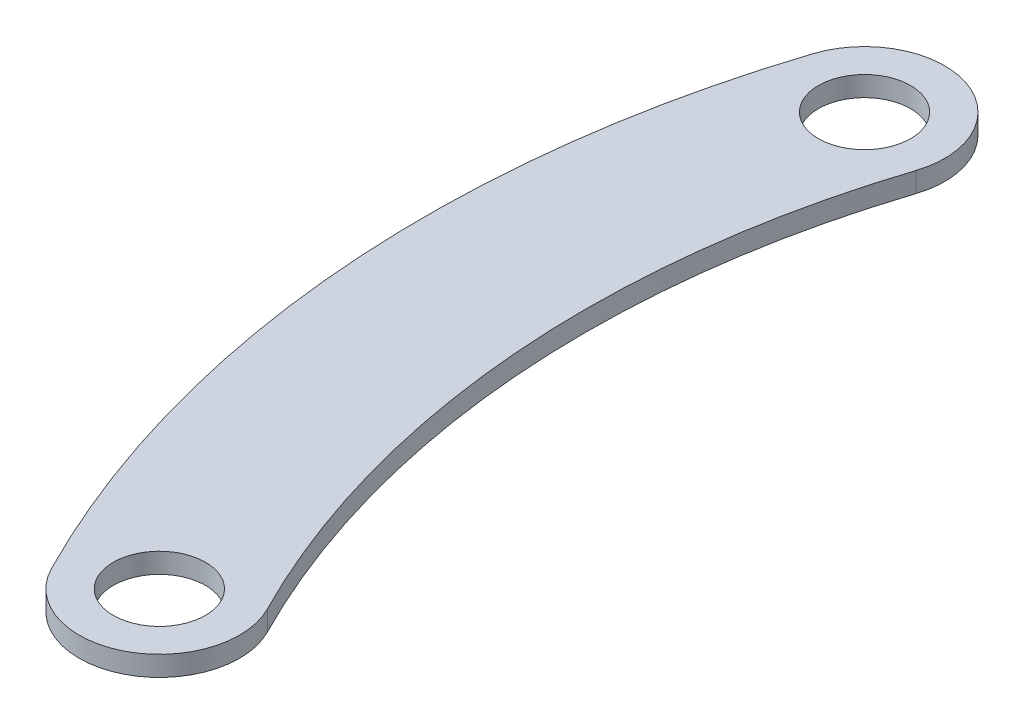
ISO-10303-21;
HEADER;
FILE_DESCRIPTION(('STEP AP214'),'2;1');
FILE_NAME('part.step','',(''),(''),'','','');
FILE_SCHEMA(('AUTOMOTIVE_DESIGN { 1 0 10303 214 1 1 1 1 }'));
ENDSEC;
DATA;
#1=APPLICATION_CONTEXT('core data for automotive mechanical design processes');
#2=APPLICATION_PROTOCOL_DEFINITION('international standard','automotive_design',2000,#1);
#3=PRODUCT_CONTEXT('',#1,'mechanical');
#4=PRODUCT('Part','Part','',(#3));
#5=PRODUCT_RELATED_PRODUCT_CATEGORY('part','',(#4));
#6=PRODUCT_DEFINITION_FORMATION('','',#4);
#7=PRODUCT_DEFINITION_CONTEXT('part definition',#1,'design');
#8=PRODUCT_DEFINITION('design','',#6,#7);
#9=PRODUCT_DEFINITION_SHAPE('','',#8);
#10=(LENGTH_UNIT() NAMED_UNIT(*) SI_UNIT(.MILLI.,.METRE.));
#11=(NAMED_UNIT(*) PLANE_ANGLE_UNIT() SI_UNIT($,.RADIAN.));
#12=(NAMED_UNIT(*) SI_UNIT($,.STERADIAN.) SOLID_ANGLE_UNIT());
#13=UNCERTAINTY_MEASURE_WITH_UNIT(LENGTH_MEASURE(1.E-05),#10,'distance_accuracy_value','');
#14=(GEOMETRIC_REPRESENTATION_CONTEXT(3) GLOBAL_UNCERTAINTY_ASSIGNED_CONTEXT((#13)) GLOBAL_UNIT_ASSIGNED_CONTEXT((#10,
#11,#12)) REPRESENTATION_CONTEXT('',''));
#15=CARTESIAN_POINT('',(0.,0.,0.));
#16=DIRECTION('',(0.,0.,1.));
#17=DIRECTION('',(1.,0.,0.));
#18=AXIS2_PLACEMENT_3D('',#15,#16,#17);
#19=CARTESIAN_POINT('',(-128.550200418903,1.8375,3.64745578806773));
#20=DIRECTION('',(0.,1.,0.));
#21=DIRECTION('',(0.,0.,1.));
#22=AXIS2_PLACEMENT_3D('',#19,#20,#21);
#23=PLANE('',#22);
#24=CARTESIAN_POINT('',(-144.599606430885,1.8375,-1.56619856013611));
#25=DIRECTION('',(0.,1.,0.));
#26=DIRECTION('',(0.,0.,1.));
#27=AXIS2_PLACEMENT_3D('',#24,#25,#26);
#28=CIRCLE('',#27,1.54999999999999);
#29=CARTESIAN_POINT('',(-144.599606430885,1.8375,-0.0161985601361142));
#30=VERTEX_POINT('',#29);
#31=EDGE_CURVE('E117',#30,#30,#28,.T.);
#32=ORIENTED_EDGE('',*,*,#31,.F.);
#33=EDGE_LOOP('',(#32));
#34=FACE_BOUND('',#33,.T.);
#35=CARTESIAN_POINT('',(-142.571302745854,1.8375,24.1851770976938));
#36=DIRECTION('',(0.,1.,0.));
#37=DIRECTION('',(0.,0.,1.));
#38=AXIS2_PLACEMENT_3D('',#35,#36,#37);
#39=CIRCLE('',#38,1.54999999999999);
#40=CARTESIAN_POINT('',(-142.571302745854,1.8375,25.7351770976938));
#41=VERTEX_POINT('',#40);
#42=EDGE_CURVE('E118',#41,#41,#39,.T.);
#43=ORIENTED_EDGE('',*,*,#42,.F.);
#44=EDGE_LOOP('',(#43));
#45=FACE_BOUND('',#44,.T.);
#46=CARTESIAN_POINT('',(-144.599606430885,1.8375,-1.56619856013611));
#47=DIRECTION('',(0.,1.,0.));
#48=DIRECTION('',(0.,0.,1.));
#49=AXIS2_PLACEMENT_3D('',#46,#47,#48);
#50=CIRCLE('',#49,2.7);
#51=CARTESIAN_POINT('',(-142.031701468968,1.8375,-0.73201386442351));
#52=VERTEX_POINT('',#51);
#53=CARTESIAN_POINT('',(-147.167511392802,1.8375,-2.40038325584874));
#54=VERTEX_POINT('',#53);
#55=EDGE_CURVE('E88',#52,#54,#50,.T.);
#56=ORIENTED_EDGE('',*,*,#55,.T.);
#57=CARTESIAN_POINT('',(-112.50079440692,1.8375,8.86111013627158));
#58=DIRECTION('',(0.,1.,0.));
#59=DIRECTION('',(0.,0.,1.));
#60=AXIS2_PLACEMENT_3D('',#57,#58,#59);
#61=CIRCLE('',#60,36.45);
#62=CARTESIAN_POINT('',(-144.976943412968,1.8375,25.4111024546076));
#63=VERTEX_POINT('',#62);
#64=EDGE_CURVE('E84',#54,#63,#61,.T.);
#65=ORIENTED_EDGE('',*,*,#64,.T.);
#66=CARTESIAN_POINT('',(-142.571302745854,1.8375,24.1851770976938));
#67=DIRECTION('',(0.,1.,0.));
#68=DIRECTION('',(0.,0.,1.));
#69=AXIS2_PLACEMENT_3D('',#66,#67,#68);
#70=CIRCLE('',#69,2.7);
#71=CARTESIAN_POINT('',(-140.165662078739,1.8375,22.95925174078));
#72=VERTEX_POINT('',#71);
#73=EDGE_CURVE('E86',#63,#72,#70,.T.);
#74=ORIENTED_EDGE('',*,*,#73,.T.);
#75=CARTESIAN_POINT('',(-112.50079440692,1.8375,8.86111013627158));
#76=DIRECTION('',(0.,-1.,0.));
#77=DIRECTION('',(0.,0.,1.));
#78=AXIS2_PLACEMENT_3D('',#75,#76,#77);
#79=CIRCLE('',#78,31.05);
#80=EDGE_CURVE('E54',#72,#52,#79,.T.);
#81=ORIENTED_EDGE('',*,*,#80,.T.);
#82=EDGE_LOOP('',(#56,#65,#74,#81));
#83=FACE_BOUND('',#82,.T.);
#84=ADVANCED_FACE('F37',(#34,#45,#83),#23,.T.);
#85=CARTESIAN_POINT('',(-128.550200418903,1.1625,3.64745578806773));
#86=DIRECTION('',(0.,1.,0.));
#87=DIRECTION('',(0.,0.,1.));
#88=AXIS2_PLACEMENT_3D('',#85,#86,#87);
#89=PLANE('',#88);
#90=CARTESIAN_POINT('',(-144.599606430885,1.1625,-1.56619856013611));
#91=DIRECTION('',(0.,1.,0.));
#92=DIRECTION('',(0.,0.,1.));
#93=AXIS2_PLACEMENT_3D('',#90,#91,#92);
#94=CIRCLE('',#93,1.54999999999999);
#95=CARTESIAN_POINT('',(-144.599606430885,1.1625,-0.0161985601361142));
#96=VERTEX_POINT('',#95);
#97=EDGE_CURVE('E103',#96,#96,#94,.F.);
#98=ORIENTED_EDGE('',*,*,#97,.F.);
#99=EDGE_LOOP('',(#98));
#100=FACE_BOUND('',#99,.T.);
#101=CARTESIAN_POINT('',(-142.571302745854,1.1625,24.1851770976938));
#102=DIRECTION('',(0.,1.,0.));
#103=DIRECTION('',(0.,0.,1.));
#104=AXIS2_PLACEMENT_3D('',#101,#102,#103);
#105=CIRCLE('',#104,1.54999999999999);
#106=CARTESIAN_POINT('',(-142.571302745854,1.1625,25.7351770976938));
#107=VERTEX_POINT('',#106);
#108=EDGE_CURVE('E114',#107,#107,#105,.F.);
#109=ORIENTED_EDGE('',*,*,#108,.F.);
#110=EDGE_LOOP('',(#109));
#111=FACE_BOUND('',#110,.T.);
#112=CARTESIAN_POINT('',(-144.599606430885,1.1625,-1.56619856013611));
#113=DIRECTION('',(0.,1.,0.));
#114=DIRECTION('',(0.,0.,1.));
#115=AXIS2_PLACEMENT_3D('',#112,#113,#114);
#116=CIRCLE('',#115,2.7);
#117=CARTESIAN_POINT('',(-142.031701468968,1.1625,-0.73201386442351));
#118=VERTEX_POINT('',#117);
#119=CARTESIAN_POINT('',(-147.167511392802,1.1625,-2.40038325584874));
#120=VERTEX_POINT('',#119);
#121=EDGE_CURVE('E100',#118,#120,#116,.T.);
#122=ORIENTED_EDGE('',*,*,#121,.F.);
#123=CARTESIAN_POINT('',(-112.50079440692,1.1625,8.86111013627158));
#124=DIRECTION('',(0.,-1.,0.));
#125=DIRECTION('',(0.,0.,1.));
#126=AXIS2_PLACEMENT_3D('',#123,#124,#125);
#127=CIRCLE('',#126,31.05);
#128=CARTESIAN_POINT('',(-140.165662078739,1.1625,22.95925174078));
#129=VERTEX_POINT('',#128);
#130=EDGE_CURVE('E77',#129,#118,#127,.T.);
#131=ORIENTED_EDGE('',*,*,#130,.F.);
#132=CARTESIAN_POINT('',(-142.571302745854,1.1625,24.1851770976938));
#133=DIRECTION('',(0.,1.,0.));
#134=DIRECTION('',(0.,0.,1.));
#135=AXIS2_PLACEMENT_3D('',#132,#133,#134);
#136=CIRCLE('',#135,2.7);
#137=CARTESIAN_POINT('',(-144.976943412968,1.1625,25.4111024546076));
#138=VERTEX_POINT('',#137);
#139=EDGE_CURVE('E71',#138,#129,#136,.T.);
#140=ORIENTED_EDGE('',*,*,#139,.F.);
#141=CARTESIAN_POINT('',(-112.50079440692,1.1625,8.86111013627158));
#142=DIRECTION('',(0.,1.,0.));
#143=DIRECTION('',(0.,0.,1.));
#144=AXIS2_PLACEMENT_3D('',#141,#142,#143);
#145=CIRCLE('',#144,36.45);
#146=EDGE_CURVE('E92',#120,#138,#145,.T.);
#147=ORIENTED_EDGE('',*,*,#146,.F.);
#148=EDGE_LOOP('',(#122,#131,#140,#147));
#149=FACE_BOUND('',#148,.T.);
#150=ADVANCED_FACE('F111',(#100,#111,#149),#89,.F.);
#151=CARTESIAN_POINT('',(-144.599606430885,1.8375,-1.56619856013611));
#152=DIRECTION('',(0.,-1.,0.));
#153=DIRECTION('',(0.,0.,-1.));
#154=AXIS2_PLACEMENT_3D('',#151,#152,#153);
#155=CYLINDRICAL_SURFACE('',#154,2.7);
#156=ORIENTED_EDGE('',*,*,#121,.T.);
#157=DIRECTION('',(0.,-1.,0.));
#158=VECTOR('',#157,1.);
#159=CARTESIAN_POINT('',(-147.167511392802,1.8375,-2.40038325584874));
#160=LINE('',#159,#158);
#161=EDGE_CURVE('E11',#54,#120,#160,.T.);
#162=ORIENTED_EDGE('',*,*,#161,.F.);
#163=ORIENTED_EDGE('',*,*,#55,.F.);
#164=DIRECTION('',(0.,-1.,0.));
#165=VECTOR('',#164,1.);
#166=CARTESIAN_POINT('',(-142.031701468968,1.8375,-0.73201386442351));
#167=LINE('',#166,#165);
#168=EDGE_CURVE('E96',#52,#118,#167,.T.);
#169=ORIENTED_EDGE('',*,*,#168,.T.);
#170=EDGE_LOOP('',(#156,#162,#163,#169));
#171=FACE_BOUND('',#170,.T.);
#172=ADVANCED_FACE('F39',(#171),#155,.T.);
#173=CARTESIAN_POINT('',(-112.50079440692,1.8375,8.86111013627158));
#174=DIRECTION('',(0.,-1.,0.));
#175=DIRECTION('',(0.,0.,-1.));
#176=AXIS2_PLACEMENT_3D('',#173,#174,#175);
#177=CYLINDRICAL_SURFACE('',#176,36.45);
#178=ORIENTED_EDGE('',*,*,#146,.T.);
#179=DIRECTION('',(0.,-1.,0.));
#180=VECTOR('',#179,1.);
#181=CARTESIAN_POINT('',(-144.976943412968,1.8375,25.4111024546076));
#182=LINE('',#181,#180);
#183=EDGE_CURVE('E46',#63,#138,#182,.T.);
#184=ORIENTED_EDGE('',*,*,#183,.F.);
#185=ORIENTED_EDGE('',*,*,#64,.F.);
#186=ORIENTED_EDGE('',*,*,#161,.T.);
#187=EDGE_LOOP('',(#178,#184,#185,#186));
#188=FACE_BOUND('',#187,.T.);
#189=ADVANCED_FACE('F91',(#188),#177,.T.);
#190=CARTESIAN_POINT('',(-142.571302745854,1.8375,24.1851770976938));
#191=DIRECTION('',(0.,-1.,0.));
#192=DIRECTION('',(0.,0.,-1.));
#193=AXIS2_PLACEMENT_3D('',#190,#191,#192);
#194=CYLINDRICAL_SURFACE('',#193,2.7);
#195=ORIENTED_EDGE('',*,*,#139,.T.);
#196=DIRECTION('',(0.,-1.,0.));
#197=VECTOR('',#196,1.);
#198=CARTESIAN_POINT('',(-140.165662078739,1.8375,22.95925174078));
#199=LINE('',#198,#197);
#200=EDGE_CURVE('E93',#72,#129,#199,.T.);
#201=ORIENTED_EDGE('',*,*,#200,.F.);
#202=ORIENTED_EDGE('',*,*,#73,.F.);
#203=ORIENTED_EDGE('',*,*,#183,.T.);
#204=EDGE_LOOP('',(#195,#201,#202,#203));
#205=FACE_BOUND('',#204,.T.);
#206=ADVANCED_FACE('F94',(#205),#194,.T.);
#207=CARTESIAN_POINT('',(-112.50079440692,1.8375,8.86111013627158));
#208=DIRECTION('',(0.,-1.,0.));
#209=DIRECTION('',(0.,0.,-1.));
#210=AXIS2_PLACEMENT_3D('',#207,#208,#209);
#211=CYLINDRICAL_SURFACE('',#210,31.05);
#212=ORIENTED_EDGE('',*,*,#130,.T.);
#213=ORIENTED_EDGE('',*,*,#168,.F.);
#214=ORIENTED_EDGE('',*,*,#80,.F.);
#215=ORIENTED_EDGE('',*,*,#200,.T.);
#216=EDGE_LOOP('',(#212,#213,#214,#215));
#217=FACE_BOUND('',#216,.T.);
#218=ADVANCED_FACE('F108',(#217),#211,.F.);
#219=CARTESIAN_POINT('',(-142.571302745854,1.1615,24.1851770976938));
#220=DIRECTION('',(0.,1.,0.));
#221=DIRECTION('',(0.,0.,1.));
#222=AXIS2_PLACEMENT_3D('',#219,#220,#221);
#223=CYLINDRICAL_SURFACE('',#222,1.54999999999999);
#224=ORIENTED_EDGE('',*,*,#42,.T.);
#225=EDGE_LOOP('',(#224));
#226=FACE_BOUND('',#225,.T.);
#227=ORIENTED_EDGE('',*,*,#108,.T.);
#228=EDGE_LOOP('',(#227));
#229=FACE_BOUND('',#228,.T.);
#230=ADVANCED_FACE('F134',(#226,#229),#223,.F.);
#231=CARTESIAN_POINT('',(-144.599606430885,1.1615,-1.56619856013611));
#232=DIRECTION('',(0.,1.,0.));
#233=DIRECTION('',(0.,0.,1.));
#234=AXIS2_PLACEMENT_3D('',#231,#232,#233);
#235=CYLINDRICAL_SURFACE('',#234,1.54999999999999);
#236=ORIENTED_EDGE('',*,*,#31,.T.);
#237=EDGE_LOOP('',(#236));
#238=FACE_BOUND('',#237,.T.);
#239=ORIENTED_EDGE('',*,*,#97,.T.);
#240=EDGE_LOOP('',(#239));
#241=FACE_BOUND('',#240,.T.);
#242=ADVANCED_FACE('F126',(#238,#241),#235,.F.);
#243=CLOSED_SHELL('',(#84,#150,#172,#189,#206,#218,#230,#242));
#244=MANIFOLD_SOLID_BREP('B2',#243);
#245=ADVANCED_BREP_SHAPE_REPRESENTATION('',(#18,#244),#14);
#246=SHAPE_DEFINITION_REPRESENTATION(#9,#245);
ENDSEC;
END-ISO-10303-21;
